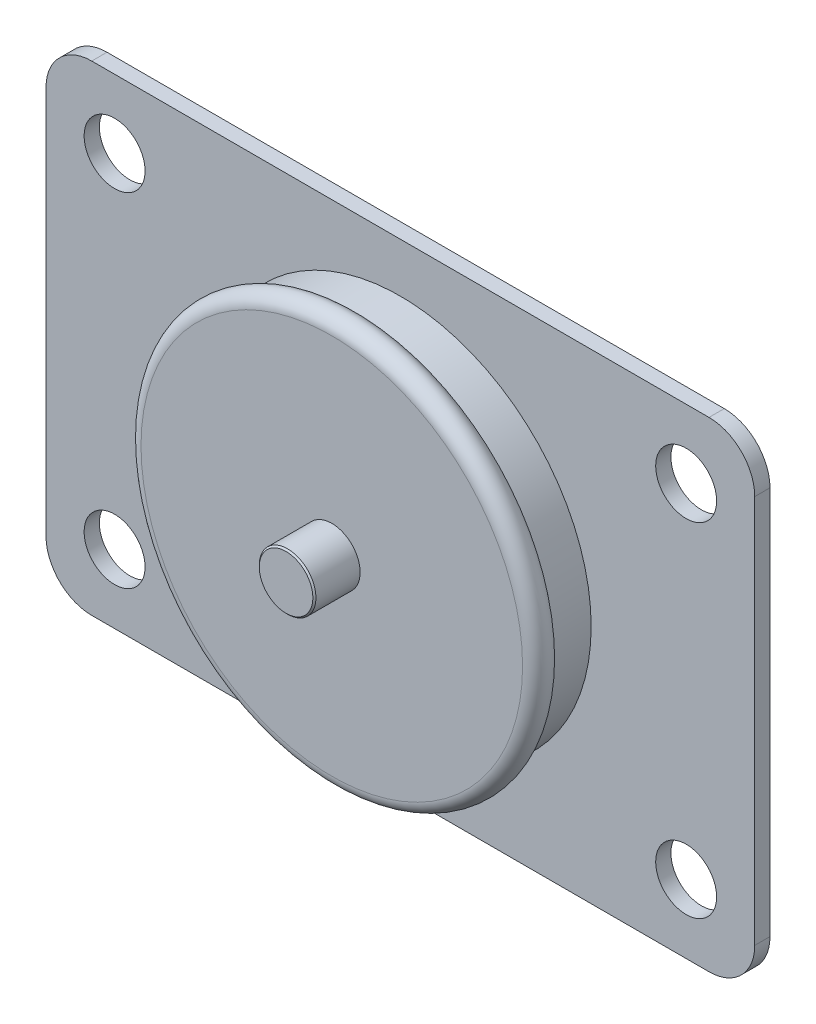
ISO-10303-21;
HEADER;
FILE_DESCRIPTION(('STEP AP214'),'2;1');
FILE_NAME('part.step','',(''),(''),'','','');
FILE_SCHEMA(('AUTOMOTIVE_DESIGN { 1 0 10303 214 1 1 1 1 }'));
ENDSEC;
DATA;
#1=APPLICATION_CONTEXT('core data for automotive mechanical design processes');
#2=APPLICATION_PROTOCOL_DEFINITION('international standard','automotive_design',2000,#1);
#3=PRODUCT_CONTEXT('',#1,'mechanical');
#4=PRODUCT('Part','Part','',(#3));
#5=PRODUCT_RELATED_PRODUCT_CATEGORY('part','',(#4));
#6=PRODUCT_DEFINITION_FORMATION('','',#4);
#7=PRODUCT_DEFINITION_CONTEXT('part definition',#1,'design');
#8=PRODUCT_DEFINITION('design','',#6,#7);
#9=PRODUCT_DEFINITION_SHAPE('','',#8);
#10=(LENGTH_UNIT() NAMED_UNIT(*) SI_UNIT(.MILLI.,.METRE.));
#11=(NAMED_UNIT(*) PLANE_ANGLE_UNIT() SI_UNIT($,.RADIAN.));
#12=(NAMED_UNIT(*) SI_UNIT($,.STERADIAN.) SOLID_ANGLE_UNIT());
#13=UNCERTAINTY_MEASURE_WITH_UNIT(LENGTH_MEASURE(1.E-05),#10,'distance_accuracy_value','');
#14=(GEOMETRIC_REPRESENTATION_CONTEXT(3) GLOBAL_UNCERTAINTY_ASSIGNED_CONTEXT((#13)) GLOBAL_UNIT_ASSIGNED_CONTEXT((#10,
#11,#12)) REPRESENTATION_CONTEXT('',''));
#15=CARTESIAN_POINT('',(0.,0.,0.));
#16=DIRECTION('',(0.,0.,1.));
#17=DIRECTION('',(1.,0.,0.));
#18=AXIS2_PLACEMENT_3D('',#15,#16,#17);
#19=CARTESIAN_POINT('',(-40.5,-25.5,-2.));
#20=DIRECTION('',(0.,0.,1.));
#21=DIRECTION('',(1.,0.,0.));
#22=AXIS2_PLACEMENT_3D('',#19,#20,#21);
#23=CYLINDRICAL_SURFACE('',#22,6.);
#24=CARTESIAN_POINT('',(-40.5,-25.5,0.));
#25=DIRECTION('',(0.,0.,1.));
#26=DIRECTION('',(-1.,0.,0.));
#27=AXIS2_PLACEMENT_3D('',#24,#25,#26);
#28=CIRCLE('',#27,6.);
#29=CARTESIAN_POINT('',(-46.5,-25.5,0.));
#30=VERTEX_POINT('',#29);
#31=CARTESIAN_POINT('',(-40.5,-31.5,0.));
#32=VERTEX_POINT('',#31);
#33=EDGE_CURVE('E152',#30,#32,#28,.T.);
#34=ORIENTED_EDGE('',*,*,#33,.F.);
#35=DIRECTION('',(0.,0.,1.));
#36=VECTOR('',#35,1.);
#37=CARTESIAN_POINT('',(-46.5,-25.5,-2.));
#38=LINE('',#37,#36);
#39=CARTESIAN_POINT('',(-46.5,-25.5,-2.));
#40=VERTEX_POINT('',#39);
#41=EDGE_CURVE('E69',#40,#30,#38,.T.);
#42=ORIENTED_EDGE('',*,*,#41,.F.);
#43=CARTESIAN_POINT('',(-40.5,-25.5,-2.));
#44=DIRECTION('',(0.,0.,1.));
#45=DIRECTION('',(-1.,0.,0.));
#46=AXIS2_PLACEMENT_3D('',#43,#44,#45);
#47=CIRCLE('',#46,6.);
#48=CARTESIAN_POINT('',(-40.5,-31.5,-2.));
#49=VERTEX_POINT('',#48);
#50=EDGE_CURVE('E174',#40,#49,#47,.T.);
#51=ORIENTED_EDGE('',*,*,#50,.T.);
#52=DIRECTION('',(0.,0.,1.));
#53=VECTOR('',#52,1.);
#54=CARTESIAN_POINT('',(-40.5,-31.5,-2.));
#55=LINE('',#54,#53);
#56=EDGE_CURVE('E110',#49,#32,#55,.T.);
#57=ORIENTED_EDGE('',*,*,#56,.T.);
#58=EDGE_LOOP('',(#34,#42,#51,#57));
#59=FACE_BOUND('',#58,.T.);
#60=ADVANCED_FACE('F49',(#59),#23,.T.);
#61=CARTESIAN_POINT('',(-46.5,-25.5,-2.));
#62=DIRECTION('',(-1.,0.,0.));
#63=DIRECTION('',(0.,0.,1.));
#64=AXIS2_PLACEMENT_3D('',#61,#62,#63);
#65=PLANE('',#64);
#66=DIRECTION('',(0.,-1.,0.));
#67=VECTOR('',#66,1.);
#68=CARTESIAN_POINT('',(-46.5,-25.5,0.));
#69=LINE('',#68,#67);
#70=CARTESIAN_POINT('',(-46.5,25.5,0.));
#71=VERTEX_POINT('',#70);
#72=EDGE_CURVE('E171',#71,#30,#69,.T.);
#73=ORIENTED_EDGE('',*,*,#72,.F.);
#74=DIRECTION('',(0.,0.,1.));
#75=VECTOR('',#74,1.);
#76=CARTESIAN_POINT('',(-46.5,25.5,-2.));
#77=LINE('',#76,#75);
#78=CARTESIAN_POINT('',(-46.5,25.5,-2.));
#79=VERTEX_POINT('',#78);
#80=EDGE_CURVE('E98',#79,#71,#77,.T.);
#81=ORIENTED_EDGE('',*,*,#80,.F.);
#82=DIRECTION('',(0.,-1.,0.));
#83=VECTOR('',#82,1.);
#84=CARTESIAN_POINT('',(-46.5,-25.5,-2.));
#85=LINE('',#84,#83);
#86=EDGE_CURVE('E142',#79,#40,#85,.T.);
#87=ORIENTED_EDGE('',*,*,#86,.T.);
#88=ORIENTED_EDGE('',*,*,#41,.T.);
#89=EDGE_LOOP('',(#73,#81,#87,#88));
#90=FACE_BOUND('',#89,.T.);
#91=ADVANCED_FACE('F239',(#90),#65,.T.);
#92=CARTESIAN_POINT('',(-40.5,25.5,-2.));
#93=DIRECTION('',(0.,0.,1.));
#94=DIRECTION('',(1.,0.,0.));
#95=AXIS2_PLACEMENT_3D('',#92,#93,#94);
#96=CYLINDRICAL_SURFACE('',#95,6.);
#97=CARTESIAN_POINT('',(-40.5,25.5,0.));
#98=DIRECTION('',(0.,0.,1.));
#99=DIRECTION('',(1.,0.,0.));
#100=AXIS2_PLACEMENT_3D('',#97,#98,#99);
#101=CIRCLE('',#100,6.);
#102=CARTESIAN_POINT('',(-40.5,31.5,0.));
#103=VERTEX_POINT('',#102);
#104=EDGE_CURVE('E129',#103,#71,#101,.T.);
#105=ORIENTED_EDGE('',*,*,#104,.F.);
#106=DIRECTION('',(0.,0.,1.));
#107=VECTOR('',#106,1.);
#108=CARTESIAN_POINT('',(-40.5,31.5,-2.));
#109=LINE('',#108,#107);
#110=CARTESIAN_POINT('',(-40.5,31.5,-2.));
#111=VERTEX_POINT('',#110);
#112=EDGE_CURVE('E124',#111,#103,#109,.T.);
#113=ORIENTED_EDGE('',*,*,#112,.F.);
#114=CARTESIAN_POINT('',(-40.5,25.5,-2.));
#115=DIRECTION('',(0.,0.,1.));
#116=DIRECTION('',(1.,0.,0.));
#117=AXIS2_PLACEMENT_3D('',#114,#115,#116);
#118=CIRCLE('',#117,6.);
#119=EDGE_CURVE('E127',#111,#79,#118,.T.);
#120=ORIENTED_EDGE('',*,*,#119,.T.);
#121=ORIENTED_EDGE('',*,*,#80,.T.);
#122=EDGE_LOOP('',(#105,#113,#120,#121));
#123=FACE_BOUND('',#122,.T.);
#124=ADVANCED_FACE('F126',(#123),#96,.T.);
#125=CARTESIAN_POINT('',(40.4999999999999,31.5,-2.));
#126=DIRECTION('',(0.,1.,0.));
#127=DIRECTION('',(-1.,0.,0.));
#128=AXIS2_PLACEMENT_3D('',#125,#126,#127);
#129=PLANE('',#128);
#130=DIRECTION('',(-1.,0.,0.));
#131=VECTOR('',#130,1.);
#132=CARTESIAN_POINT('',(40.4999999999999,31.5,0.));
#133=LINE('',#132,#131);
#134=CARTESIAN_POINT('',(40.4999999999999,31.5,0.));
#135=VERTEX_POINT('',#134);
#136=EDGE_CURVE('E168',#135,#103,#133,.T.);
#137=ORIENTED_EDGE('',*,*,#136,.F.);
#138=DIRECTION('',(0.,0.,1.));
#139=VECTOR('',#138,1.);
#140=CARTESIAN_POINT('',(40.4999999999999,31.5,-2.));
#141=LINE('',#140,#139);
#142=CARTESIAN_POINT('',(40.4999999999999,31.5,-2.));
#143=VERTEX_POINT('',#142);
#144=EDGE_CURVE('E134',#143,#135,#141,.T.);
#145=ORIENTED_EDGE('',*,*,#144,.F.);
#146=DIRECTION('',(-1.,0.,0.));
#147=VECTOR('',#146,1.);
#148=CARTESIAN_POINT('',(40.4999999999999,31.5,-2.));
#149=LINE('',#148,#147);
#150=EDGE_CURVE('E140',#143,#111,#149,.T.);
#151=ORIENTED_EDGE('',*,*,#150,.T.);
#152=ORIENTED_EDGE('',*,*,#112,.T.);
#153=EDGE_LOOP('',(#137,#145,#151,#152));
#154=FACE_BOUND('',#153,.T.);
#155=ADVANCED_FACE('F144',(#154),#129,.T.);
#156=CARTESIAN_POINT('',(40.5,25.5,-2.));
#157=DIRECTION('',(0.,0.,1.));
#158=DIRECTION('',(1.,0.,0.));
#159=AXIS2_PLACEMENT_3D('',#156,#157,#158);
#160=CYLINDRICAL_SURFACE('',#159,6.);
#161=CARTESIAN_POINT('',(40.5,25.5,0.));
#162=DIRECTION('',(0.,0.,1.));
#163=DIRECTION('',(1.,0.,0.));
#164=AXIS2_PLACEMENT_3D('',#161,#162,#163);
#165=CIRCLE('',#164,6.);
#166=CARTESIAN_POINT('',(46.5,25.5,0.));
#167=VERTEX_POINT('',#166);
#168=EDGE_CURVE('E165',#167,#135,#165,.T.);
#169=ORIENTED_EDGE('',*,*,#168,.F.);
#170=DIRECTION('',(0.,0.,1.));
#171=VECTOR('',#170,1.);
#172=CARTESIAN_POINT('',(46.5,25.5,-2.));
#173=LINE('',#172,#171);
#174=CARTESIAN_POINT('',(46.5,25.5,-2.));
#175=VERTEX_POINT('',#174);
#176=EDGE_CURVE('E179',#175,#167,#173,.T.);
#177=ORIENTED_EDGE('',*,*,#176,.F.);
#178=CARTESIAN_POINT('',(40.5,25.5,-2.));
#179=DIRECTION('',(0.,0.,1.));
#180=DIRECTION('',(1.,0.,0.));
#181=AXIS2_PLACEMENT_3D('',#178,#179,#180);
#182=CIRCLE('',#181,6.);
#183=EDGE_CURVE('E145',#175,#143,#182,.T.);
#184=ORIENTED_EDGE('',*,*,#183,.T.);
#185=ORIENTED_EDGE('',*,*,#144,.T.);
#186=EDGE_LOOP('',(#169,#177,#184,#185));
#187=FACE_BOUND('',#186,.T.);
#188=ADVANCED_FACE('F252',(#187),#160,.T.);
#189=CARTESIAN_POINT('',(46.5,-25.5,-2.));
#190=DIRECTION('',(1.,0.,0.));
#191=DIRECTION('',(0.,0.,-1.));
#192=AXIS2_PLACEMENT_3D('',#189,#190,#191);
#193=PLANE('',#192);
#194=DIRECTION('',(0.,1.,0.));
#195=VECTOR('',#194,1.);
#196=CARTESIAN_POINT('',(46.5,-25.5,0.));
#197=LINE('',#196,#195);
#198=CARTESIAN_POINT('',(46.5,-25.5,0.));
#199=VERTEX_POINT('',#198);
#200=EDGE_CURVE('E162',#199,#167,#197,.T.);
#201=ORIENTED_EDGE('',*,*,#200,.F.);
#202=DIRECTION('',(0.,0.,1.));
#203=VECTOR('',#202,1.);
#204=CARTESIAN_POINT('',(46.5,-25.5,-2.));
#205=LINE('',#204,#203);
#206=CARTESIAN_POINT('',(46.5,-25.5,-2.));
#207=VERTEX_POINT('',#206);
#208=EDGE_CURVE('E181',#207,#199,#205,.T.);
#209=ORIENTED_EDGE('',*,*,#208,.F.);
#210=DIRECTION('',(0.,1.,0.));
#211=VECTOR('',#210,1.);
#212=CARTESIAN_POINT('',(46.5,-25.5,-2.));
#213=LINE('',#212,#211);
#214=EDGE_CURVE('E147',#207,#175,#213,.T.);
#215=ORIENTED_EDGE('',*,*,#214,.T.);
#216=ORIENTED_EDGE('',*,*,#176,.T.);
#217=EDGE_LOOP('',(#201,#209,#215,#216));
#218=FACE_BOUND('',#217,.T.);
#219=ADVANCED_FACE('F230',(#218),#193,.T.);
#220=CARTESIAN_POINT('',(40.5,-25.5,-2.));
#221=DIRECTION('',(0.,0.,1.));
#222=DIRECTION('',(1.,0.,0.));
#223=AXIS2_PLACEMENT_3D('',#220,#221,#222);
#224=CYLINDRICAL_SURFACE('',#223,6.);
#225=CARTESIAN_POINT('',(40.5,-25.5,0.));
#226=DIRECTION('',(0.,0.,1.));
#227=DIRECTION('',(1.,0.,0.));
#228=AXIS2_PLACEMENT_3D('',#225,#226,#227);
#229=CIRCLE('',#228,6.);
#230=CARTESIAN_POINT('',(40.4999999999999,-31.5,0.));
#231=VERTEX_POINT('',#230);
#232=EDGE_CURVE('E159',#231,#199,#229,.T.);
#233=ORIENTED_EDGE('',*,*,#232,.F.);
#234=DIRECTION('',(0.,0.,1.));
#235=VECTOR('',#234,1.);
#236=CARTESIAN_POINT('',(40.4999999999999,-31.5,-2.));
#237=LINE('',#236,#235);
#238=CARTESIAN_POINT('',(40.4999999999999,-31.5,-2.));
#239=VERTEX_POINT('',#238);
#240=EDGE_CURVE('E183',#239,#231,#237,.T.);
#241=ORIENTED_EDGE('',*,*,#240,.F.);
#242=CARTESIAN_POINT('',(40.5,-25.5,-2.));
#243=DIRECTION('',(0.,0.,1.));
#244=DIRECTION('',(1.,0.,0.));
#245=AXIS2_PLACEMENT_3D('',#242,#243,#244);
#246=CIRCLE('',#245,6.);
#247=EDGE_CURVE('E224',#239,#207,#246,.T.);
#248=ORIENTED_EDGE('',*,*,#247,.T.);
#249=ORIENTED_EDGE('',*,*,#208,.T.);
#250=EDGE_LOOP('',(#233,#241,#248,#249));
#251=FACE_BOUND('',#250,.T.);
#252=ADVANCED_FACE('F235',(#251),#224,.T.);
#253=CARTESIAN_POINT('',(40.4999999999999,-31.5,-2.));
#254=DIRECTION('',(0.,-1.,0.));
#255=DIRECTION('',(1.,0.,0.));
#256=AXIS2_PLACEMENT_3D('',#253,#254,#255);
#257=PLANE('',#256);
#258=DIRECTION('',(1.,0.,0.));
#259=VECTOR('',#258,1.);
#260=CARTESIAN_POINT('',(40.4999999999999,-31.5,0.));
#261=LINE('',#260,#259);
#262=EDGE_CURVE('E155',#32,#231,#261,.T.);
#263=ORIENTED_EDGE('',*,*,#262,.F.);
#264=ORIENTED_EDGE('',*,*,#56,.F.);
#265=DIRECTION('',(1.,0.,0.));
#266=VECTOR('',#265,1.);
#267=CARTESIAN_POINT('',(40.4999999999999,-31.5,-2.));
#268=LINE('',#267,#266);
#269=EDGE_CURVE('E222',#49,#239,#268,.T.);
#270=ORIENTED_EDGE('',*,*,#269,.T.);
#271=ORIENTED_EDGE('',*,*,#240,.T.);
#272=EDGE_LOOP('',(#263,#264,#270,#271));
#273=FACE_BOUND('',#272,.T.);
#274=ADVANCED_FACE('F236',(#273),#257,.T.);
#275=CARTESIAN_POINT('',(-40.5,-25.5,-2.));
#276=DIRECTION('',(0.,0.,-1.));
#277=DIRECTION('',(-1.,0.,0.));
#278=AXIS2_PLACEMENT_3D('',#275,#276,#277);
#279=PLANE('',#278);
#280=CARTESIAN_POINT('',(-37.5,22.5,-2.));
#281=DIRECTION('',(0.,0.,-1.));
#282=DIRECTION('',(-1.,0.,0.));
#283=AXIS2_PLACEMENT_3D('',#280,#281,#282);
#284=CIRCLE('',#283,4.00000000000001);
#285=CARTESIAN_POINT('',(-41.5,22.5,-2.));
#286=VERTEX_POINT('',#285);
#287=EDGE_CURVE('E333',#286,#286,#284,.T.);
#288=ORIENTED_EDGE('',*,*,#287,.F.);
#289=EDGE_LOOP('',(#288));
#290=FACE_BOUND('',#289,.T.);
#291=CARTESIAN_POINT('',(-37.5,-22.5,-2.));
#292=DIRECTION('',(0.,0.,-1.));
#293=DIRECTION('',(-1.,0.,0.));
#294=AXIS2_PLACEMENT_3D('',#291,#292,#293);
#295=CIRCLE('',#294,4.00000000000001);
#296=CARTESIAN_POINT('',(-41.5,-22.5,-2.));
#297=VERTEX_POINT('',#296);
#298=EDGE_CURVE('E329',#297,#297,#295,.T.);
#299=ORIENTED_EDGE('',*,*,#298,.F.);
#300=EDGE_LOOP('',(#299));
#301=FACE_BOUND('',#300,.T.);
#302=CARTESIAN_POINT('',(37.5,-22.5,-2.));
#303=DIRECTION('',(0.,0.,-1.));
#304=DIRECTION('',(-1.,0.,0.));
#305=AXIS2_PLACEMENT_3D('',#302,#303,#304);
#306=CIRCLE('',#305,4.00000000000001);
#307=CARTESIAN_POINT('',(33.5,-22.5,-2.));
#308=VERTEX_POINT('',#307);
#309=EDGE_CURVE('E319',#308,#308,#306,.T.);
#310=ORIENTED_EDGE('',*,*,#309,.F.);
#311=EDGE_LOOP('',(#310));
#312=FACE_BOUND('',#311,.T.);
#313=CARTESIAN_POINT('',(37.5,22.5,-2.));
#314=DIRECTION('',(0.,0.,-1.));
#315=DIRECTION('',(-1.,0.,0.));
#316=AXIS2_PLACEMENT_3D('',#313,#314,#315);
#317=CIRCLE('',#316,4.00000000000001);
#318=CARTESIAN_POINT('',(33.5,22.5,-2.));
#319=VERTEX_POINT('',#318);
#320=EDGE_CURVE('E192',#319,#319,#317,.T.);
#321=ORIENTED_EDGE('',*,*,#320,.F.);
#322=EDGE_LOOP('',(#321));
#323=FACE_BOUND('',#322,.T.);
#324=CARTESIAN_POINT('',(0.,0.,-2.));
#325=DIRECTION('',(0.,0.,-1.));
#326=DIRECTION('',(-1.,0.,0.));
#327=AXIS2_PLACEMENT_3D('',#324,#325,#326);
#328=CIRCLE('',#327,25.);
#329=CARTESIAN_POINT('',(-25.,0.,-2.));
#330=VERTEX_POINT('',#329);
#331=EDGE_CURVE('E199',#330,#330,#328,.T.);
#332=ORIENTED_EDGE('',*,*,#331,.F.);
#333=EDGE_LOOP('',(#332));
#334=FACE_BOUND('',#333,.T.);
#335=ORIENTED_EDGE('',*,*,#50,.F.);
#336=ORIENTED_EDGE('',*,*,#86,.F.);
#337=ORIENTED_EDGE('',*,*,#119,.F.);
#338=ORIENTED_EDGE('',*,*,#150,.F.);
#339=ORIENTED_EDGE('',*,*,#183,.F.);
#340=ORIENTED_EDGE('',*,*,#214,.F.);
#341=ORIENTED_EDGE('',*,*,#247,.F.);
#342=ORIENTED_EDGE('',*,*,#269,.F.);
#343=EDGE_LOOP('',(#335,#336,#337,#338,#339,#340,#341,#342));
#344=FACE_BOUND('',#343,.T.);
#345=ADVANCED_FACE('F138',(#290,#301,#312,#323,#334,#344),#279,.T.);
#346=CARTESIAN_POINT('',(-40.5,-25.5,0.));
#347=DIRECTION('',(0.,0.,-1.));
#348=DIRECTION('',(-1.,0.,0.));
#349=AXIS2_PLACEMENT_3D('',#346,#347,#348);
#350=PLANE('',#349);
#351=CARTESIAN_POINT('',(-37.5,22.5,0.));
#352=DIRECTION('',(0.,0.,-1.));
#353=DIRECTION('',(-1.,0.,0.));
#354=AXIS2_PLACEMENT_3D('',#351,#352,#353);
#355=CIRCLE('',#354,4.00000000000001);
#356=CARTESIAN_POINT('',(-41.5,22.5,0.));
#357=VERTEX_POINT('',#356);
#358=EDGE_CURVE('E54',#357,#357,#355,.T.);
#359=ORIENTED_EDGE('',*,*,#358,.T.);
#360=EDGE_LOOP('',(#359));
#361=FACE_BOUND('',#360,.T.);
#362=CARTESIAN_POINT('',(-37.5,-22.5,0.));
#363=DIRECTION('',(0.,0.,-1.));
#364=DIRECTION('',(-1.,0.,0.));
#365=AXIS2_PLACEMENT_3D('',#362,#363,#364);
#366=CIRCLE('',#365,4.00000000000001);
#367=CARTESIAN_POINT('',(-41.5,-22.5,0.));
#368=VERTEX_POINT('',#367);
#369=EDGE_CURVE('E194',#368,#368,#366,.T.);
#370=ORIENTED_EDGE('',*,*,#369,.T.);
#371=EDGE_LOOP('',(#370));
#372=FACE_BOUND('',#371,.T.);
#373=CARTESIAN_POINT('',(37.5,-22.5,0.));
#374=DIRECTION('',(0.,0.,-1.));
#375=DIRECTION('',(-1.,0.,0.));
#376=AXIS2_PLACEMENT_3D('',#373,#374,#375);
#377=CIRCLE('',#376,4.00000000000001);
#378=CARTESIAN_POINT('',(33.5,-22.5,0.));
#379=VERTEX_POINT('',#378);
#380=EDGE_CURVE('E191',#379,#379,#377,.T.);
#381=ORIENTED_EDGE('',*,*,#380,.T.);
#382=EDGE_LOOP('',(#381));
#383=FACE_BOUND('',#382,.T.);
#384=CARTESIAN_POINT('',(37.5,22.5,0.));
#385=DIRECTION('',(0.,0.,-1.));
#386=DIRECTION('',(-1.,0.,0.));
#387=AXIS2_PLACEMENT_3D('',#384,#385,#386);
#388=CIRCLE('',#387,4.00000000000001);
#389=CARTESIAN_POINT('',(33.5,22.5,0.));
#390=VERTEX_POINT('',#389);
#391=EDGE_CURVE('E188',#390,#390,#388,.T.);
#392=ORIENTED_EDGE('',*,*,#391,.T.);
#393=EDGE_LOOP('',(#392));
#394=FACE_BOUND('',#393,.T.);
#395=CARTESIAN_POINT('',(0.,0.,0.));
#396=DIRECTION('',(0.,0.,1.));
#397=DIRECTION('',(1.,0.,0.));
#398=AXIS2_PLACEMENT_3D('',#395,#396,#397);
#399=CIRCLE('',#398,25.0347916685978);
#400=CARTESIAN_POINT('',(25.0347916685978,0.,0.));
#401=VERTEX_POINT('',#400);
#402=EDGE_CURVE('E176',#401,#401,#399,.T.);
#403=ORIENTED_EDGE('',*,*,#402,.F.);
#404=EDGE_LOOP('',(#403));
#405=FACE_BOUND('',#404,.T.);
#406=ORIENTED_EDGE('',*,*,#33,.T.);
#407=ORIENTED_EDGE('',*,*,#262,.T.);
#408=ORIENTED_EDGE('',*,*,#232,.T.);
#409=ORIENTED_EDGE('',*,*,#200,.T.);
#410=ORIENTED_EDGE('',*,*,#168,.T.);
#411=ORIENTED_EDGE('',*,*,#136,.T.);
#412=ORIENTED_EDGE('',*,*,#104,.T.);
#413=ORIENTED_EDGE('',*,*,#72,.T.);
#414=EDGE_LOOP('',(#406,#407,#408,#409,#410,#411,#412,#413));
#415=FACE_BOUND('',#414,.T.);
#416=ADVANCED_FACE('F238',(#361,#372,#383,#394,#405,#415),#350,.F.);
#417=CARTESIAN_POINT('',(0.,0.,8.99999999999999));
#418=DIRECTION('',(0.,0.,-1.));
#419=DIRECTION('',(-1.,0.,0.));
#420=AXIS2_PLACEMENT_3D('',#417,#418,#419);
#421=CYLINDRICAL_SURFACE('',#420,25.0347916685978);
#422=CARTESIAN_POINT('',(0.,0.,5.52025727117513));
#423=DIRECTION('',(0.,0.,1.));
#424=DIRECTION('',(1.,0.,0.));
#425=AXIS2_PLACEMENT_3D('',#422,#423,#424);
#426=CIRCLE('',#425,25.0347916685978);
#427=CARTESIAN_POINT('',(25.0347916685978,0.,5.52025727117513));
#428=VERTEX_POINT('',#427);
#429=EDGE_CURVE('E156',#428,#428,#426,.F.);
#430=ORIENTED_EDGE('',*,*,#429,.T.);
#431=EDGE_LOOP('',(#430));
#432=FACE_BOUND('',#431,.T.);
#433=ORIENTED_EDGE('',*,*,#402,.T.);
#434=EDGE_LOOP('',(#433));
#435=FACE_BOUND('',#434,.T.);
#436=ADVANCED_FACE('F270',(#432,#435),#421,.T.);
#437=CARTESIAN_POINT('',(0.,0.,7.26012863558756));
#438=DIRECTION('',(0.,0.,-1.));
#439=DIRECTION('',(-1.,0.,0.));
#440=AXIS2_PLACEMENT_3D('',#437,#438,#439);
#441=TOROIDAL_SURFACE('',#440,25.0347916685978,1.73987136441243);
#442=CARTESIAN_POINT('',(0.,0.,8.99999999999999));
#443=DIRECTION('',(0.,0.,-1.));
#444=DIRECTION('',(-1.,0.,0.));
#445=AXIS2_PLACEMENT_3D('',#442,#443,#444);
#446=CIRCLE('',#445,25.0347916685978);
#447=CARTESIAN_POINT('',(-25.0347916685978,0.,8.99999999999999));
#448=VERTEX_POINT('',#447);
#449=EDGE_CURVE('E214',#448,#448,#446,.T.);
#450=ORIENTED_EDGE('',*,*,#449,.T.);
#451=EDGE_LOOP('',(#450));
#452=FACE_BOUND('',#451,.T.);
#453=ORIENTED_EDGE('',*,*,#429,.F.);
#454=EDGE_LOOP('',(#453));
#455=FACE_BOUND('',#454,.T.);
#456=ADVANCED_FACE('F275',(#452,#455),#441,.T.);
#457=CARTESIAN_POINT('',(0.,0.,8.99999999999999));
#458=DIRECTION('',(0.,0.,1.));
#459=DIRECTION('',(1.,0.,0.));
#460=AXIS2_PLACEMENT_3D('',#457,#458,#459);
#461=PLANE('',#460);
#462=CARTESIAN_POINT('',(0.,0.,8.99999999999999));
#463=DIRECTION('',(0.,0.,1.));
#464=DIRECTION('',(1.,0.,0.));
#465=AXIS2_PLACEMENT_3D('',#462,#463,#464);
#466=CIRCLE('',#465,3.71698285537209);
#467=CARTESIAN_POINT('',(3.71698285537209,0.,8.99999999999999));
#468=VERTEX_POINT('',#467);
#469=EDGE_CURVE('E208',#468,#468,#466,.T.);
#470=ORIENTED_EDGE('',*,*,#469,.F.);
#471=EDGE_LOOP('',(#470));
#472=FACE_BOUND('',#471,.T.);
#473=ORIENTED_EDGE('',*,*,#449,.F.);
#474=EDGE_LOOP('',(#473));
#475=FACE_BOUND('',#474,.T.);
#476=ADVANCED_FACE('F277',(#472,#475),#461,.T.);
#477=CARTESIAN_POINT('',(0.,0.,15.));
#478=DIRECTION('',(0.,0.,-1.));
#479=DIRECTION('',(-1.,0.,0.));
#480=AXIS2_PLACEMENT_3D('',#477,#478,#479);
#481=CYLINDRICAL_SURFACE('',#480,3.71698285537209);
#482=CARTESIAN_POINT('',(0.,0.,14.8));
#483=DIRECTION('',(0.,0.,1.));
#484=DIRECTION('',(1.,0.,0.));
#485=AXIS2_PLACEMENT_3D('',#482,#483,#484);
#486=CIRCLE('',#485,3.71698285537209);
#487=CARTESIAN_POINT('',(3.71698285537209,0.,14.8));
#488=VERTEX_POINT('',#487);
#489=EDGE_CURVE('E11',#488,#488,#486,.F.);
#490=ORIENTED_EDGE('',*,*,#489,.T.);
#491=EDGE_LOOP('',(#490));
#492=FACE_BOUND('',#491,.T.);
#493=ORIENTED_EDGE('',*,*,#469,.T.);
#494=EDGE_LOOP('',(#493));
#495=FACE_BOUND('',#494,.T.);
#496=ADVANCED_FACE('F280',(#492,#495),#481,.T.);
#497=CARTESIAN_POINT('',(0.,0.,15.));
#498=DIRECTION('',(0.,0.,1.));
#499=DIRECTION('',(1.,0.,0.));
#500=AXIS2_PLACEMENT_3D('',#497,#498,#499);
#501=PLANE('',#500);
#502=CARTESIAN_POINT('',(0.,0.,15.));
#503=DIRECTION('',(0.,0.,1.));
#504=DIRECTION('',(1.,0.,0.));
#505=AXIS2_PLACEMENT_3D('',#502,#503,#504);
#506=CIRCLE('',#505,3.51698285537211);
#507=CARTESIAN_POINT('',(3.51698285537211,0.,15.));
#508=VERTEX_POINT('',#507);
#509=EDGE_CURVE('E60',#508,#508,#506,.T.);
#510=ORIENTED_EDGE('',*,*,#509,.T.);
#511=EDGE_LOOP('',(#510));
#512=FACE_BOUND('',#511,.T.);
#513=ADVANCED_FACE('F287',(#512),#501,.T.);
#514=CARTESIAN_POINT('',(0.,0.,15.));
#515=DIRECTION('',(0.,0.,-1.));
#516=DIRECTION('',(-1.,0.,0.));
#517=AXIS2_PLACEMENT_3D('',#514,#515,#516);
#518=CONICAL_SURFACE('',#517,3.51698285537211,0.785398163397434);
#519=ORIENTED_EDGE('',*,*,#489,.F.);
#520=EDGE_LOOP('',(#519));
#521=FACE_BOUND('',#520,.T.);
#522=ORIENTED_EDGE('',*,*,#509,.F.);
#523=EDGE_LOOP('',(#522));
#524=FACE_BOUND('',#523,.T.);
#525=ADVANCED_FACE('F52',(#521,#524),#518,.T.);
#526=CARTESIAN_POINT('',(0.,0.,-1.64));
#527=DIRECTION('',(0.,0.,-1.));
#528=DIRECTION('',(-1.,0.,0.));
#529=AXIS2_PLACEMENT_3D('',#526,#527,#528);
#530=CYLINDRICAL_SURFACE('',#529,25.);
#531=CARTESIAN_POINT('',(0.,0.,-1.64));
#532=DIRECTION('',(0.,0.,-1.));
#533=DIRECTION('',(-1.,0.,0.));
#534=AXIS2_PLACEMENT_3D('',#531,#532,#533);
#535=CIRCLE('',#534,25.);
#536=CARTESIAN_POINT('',(-25.,0.,-1.64));
#537=VERTEX_POINT('',#536);
#538=EDGE_CURVE('E203',#537,#537,#535,.T.);
#539=ORIENTED_EDGE('',*,*,#538,.F.);
#540=EDGE_LOOP('',(#539));
#541=FACE_BOUND('',#540,.T.);
#542=ORIENTED_EDGE('',*,*,#331,.T.);
#543=EDGE_LOOP('',(#542));
#544=FACE_BOUND('',#543,.T.);
#545=ADVANCED_FACE('F292',(#541,#544),#530,.F.);
#546=CARTESIAN_POINT('',(0.,0.,-1.64));
#547=DIRECTION('',(0.,0.,-1.));
#548=DIRECTION('',(-1.,0.,0.));
#549=AXIS2_PLACEMENT_3D('',#546,#547,#548);
#550=PLANE('',#549);
#551=ORIENTED_EDGE('',*,*,#538,.T.);
#552=EDGE_LOOP('',(#551));
#553=FACE_BOUND('',#552,.T.);
#554=ADVANCED_FACE('F295',(#553),#550,.T.);
#555=CARTESIAN_POINT('',(37.5,22.5,33.));
#556=DIRECTION('',(0.,0.,-1.));
#557=DIRECTION('',(-1.,0.,0.));
#558=AXIS2_PLACEMENT_3D('',#555,#556,#557);
#559=CYLINDRICAL_SURFACE('',#558,4.00000000000001);
#560=ORIENTED_EDGE('',*,*,#320,.T.);
#561=EDGE_LOOP('',(#560));
#562=FACE_BOUND('',#561,.T.);
#563=ORIENTED_EDGE('',*,*,#391,.F.);
#564=EDGE_LOOP('',(#563));
#565=FACE_BOUND('',#564,.T.);
#566=ADVANCED_FACE('F298',(#562,#565),#559,.F.);
#567=CARTESIAN_POINT('',(37.5,-22.5,33.));
#568=DIRECTION('',(0.,0.,-1.));
#569=DIRECTION('',(-1.,0.,0.));
#570=AXIS2_PLACEMENT_3D('',#567,#568,#569);
#571=CYLINDRICAL_SURFACE('',#570,4.00000000000001);
#572=ORIENTED_EDGE('',*,*,#309,.T.);
#573=EDGE_LOOP('',(#572));
#574=FACE_BOUND('',#573,.T.);
#575=ORIENTED_EDGE('',*,*,#380,.F.);
#576=EDGE_LOOP('',(#575));
#577=FACE_BOUND('',#576,.T.);
#578=ADVANCED_FACE('F302',(#574,#577),#571,.F.);
#579=CARTESIAN_POINT('',(-37.5,-22.5,33.));
#580=DIRECTION('',(0.,0.,-1.));
#581=DIRECTION('',(-1.,0.,0.));
#582=AXIS2_PLACEMENT_3D('',#579,#580,#581);
#583=CYLINDRICAL_SURFACE('',#582,4.00000000000001);
#584=ORIENTED_EDGE('',*,*,#298,.T.);
#585=EDGE_LOOP('',(#584));
#586=FACE_BOUND('',#585,.T.);
#587=ORIENTED_EDGE('',*,*,#369,.F.);
#588=EDGE_LOOP('',(#587));
#589=FACE_BOUND('',#588,.T.);
#590=ADVANCED_FACE('F307',(#586,#589),#583,.F.);
#591=CARTESIAN_POINT('',(-37.5,22.5,33.));
#592=DIRECTION('',(0.,0.,-1.));
#593=DIRECTION('',(-1.,0.,0.));
#594=AXIS2_PLACEMENT_3D('',#591,#592,#593);
#595=CYLINDRICAL_SURFACE('',#594,4.00000000000001);
#596=ORIENTED_EDGE('',*,*,#287,.T.);
#597=EDGE_LOOP('',(#596));
#598=FACE_BOUND('',#597,.T.);
#599=ORIENTED_EDGE('',*,*,#358,.F.);
#600=EDGE_LOOP('',(#599));
#601=FACE_BOUND('',#600,.T.);
#602=ADVANCED_FACE('F304',(#598,#601),#595,.F.);
#603=CLOSED_SHELL('',(#60,#91,#124,#155,#188,#219,#252,#274,#345,#416,#436,#456,#476,#496,#513,
#525,#545,#554,#566,#578,#590,#602));
#604=MANIFOLD_SOLID_BREP('B2',#603);
#605=ADVANCED_BREP_SHAPE_REPRESENTATION('',(#18,#604),#14);
#606=SHAPE_DEFINITION_REPRESENTATION(#9,#605);
ENDSEC;
END-ISO-10303-21;
